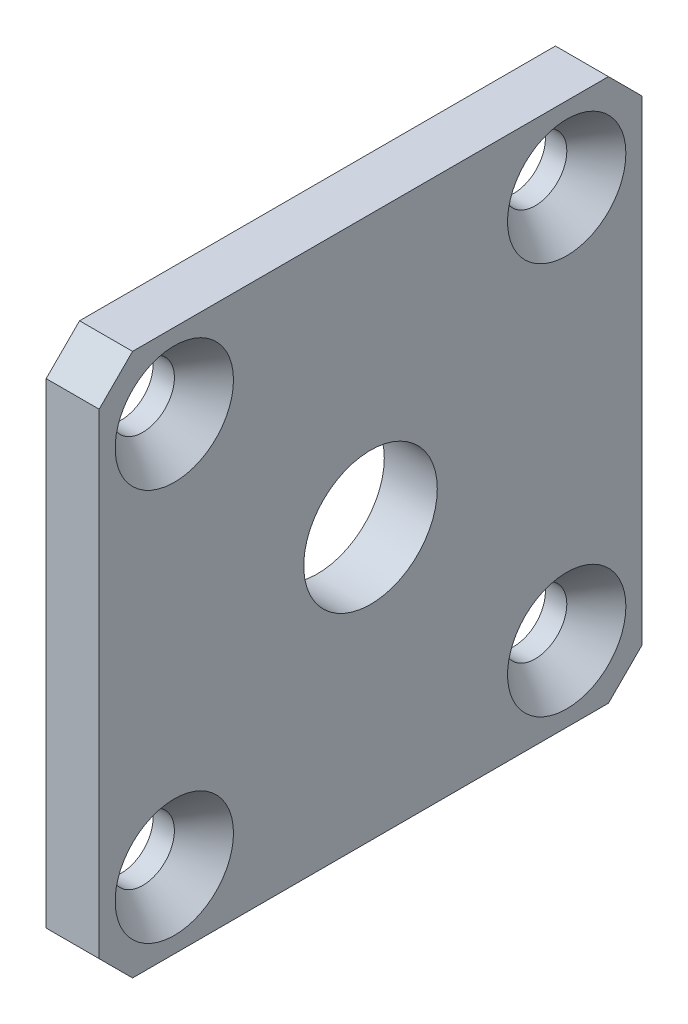
ISO-10303-21;
HEADER;
FILE_DESCRIPTION(('STEP AP214'),'2;1');
FILE_NAME('part.step','',(''),(''),'','','');
FILE_SCHEMA(('AUTOMOTIVE_DESIGN { 1 0 10303 214 1 1 1 1 }'));
ENDSEC;
DATA;
#1=APPLICATION_CONTEXT('core data for automotive mechanical design processes');
#2=APPLICATION_PROTOCOL_DEFINITION('international standard','automotive_design',2000,#1);
#3=PRODUCT_CONTEXT('',#1,'mechanical');
#4=PRODUCT('Part','Part','',(#3));
#5=PRODUCT_RELATED_PRODUCT_CATEGORY('part','',(#4));
#6=PRODUCT_DEFINITION_FORMATION('','',#4);
#7=PRODUCT_DEFINITION_CONTEXT('part definition',#1,'design');
#8=PRODUCT_DEFINITION('design','',#6,#7);
#9=PRODUCT_DEFINITION_SHAPE('','',#8);
#10=(LENGTH_UNIT() NAMED_UNIT(*) SI_UNIT(.MILLI.,.METRE.));
#11=(NAMED_UNIT(*) PLANE_ANGLE_UNIT() SI_UNIT($,.RADIAN.));
#12=(NAMED_UNIT(*) SI_UNIT($,.STERADIAN.) SOLID_ANGLE_UNIT());
#13=UNCERTAINTY_MEASURE_WITH_UNIT(LENGTH_MEASURE(1.E-05),#10,'distance_accuracy_value','');
#14=(GEOMETRIC_REPRESENTATION_CONTEXT(3) GLOBAL_UNCERTAINTY_ASSIGNED_CONTEXT((#13)) GLOBAL_UNIT_ASSIGNED_CONTEXT((#10,
#11,#12)) REPRESENTATION_CONTEXT('',''));
#15=CARTESIAN_POINT('',(0.,0.,0.));
#16=DIRECTION('',(0.,0.,1.));
#17=DIRECTION('',(1.,0.,0.));
#18=AXIS2_PLACEMENT_3D('',#15,#16,#17);
#19=CARTESIAN_POINT('',(3.175,0.,0.));
#20=DIRECTION('',(1.,0.,0.));
#21=DIRECTION('',(0.,0.,-1.));
#22=AXIS2_PLACEMENT_3D('',#19,#20,#21);
#23=PLANE('',#22);
#24=CARTESIAN_POINT('',(3.175,11.75,11.75));
#25=DIRECTION('',(1.,0.,0.));
#26=DIRECTION('',(0.,0.,-1.));
#27=AXIS2_PLACEMENT_3D('',#24,#25,#26);
#28=CIRCLE('',#27,3.5433);
#29=CARTESIAN_POINT('',(3.175,11.75,8.2067));
#30=VERTEX_POINT('',#29);
#31=EDGE_CURVE('E219',#30,#30,#28,.T.);
#32=ORIENTED_EDGE('',*,*,#31,.F.);
#33=EDGE_LOOP('',(#32));
#34=FACE_BOUND('',#33,.T.);
#35=CARTESIAN_POINT('',(3.175,11.75,-11.75));
#36=DIRECTION('',(1.,0.,0.));
#37=DIRECTION('',(0.,0.,-1.));
#38=AXIS2_PLACEMENT_3D('',#35,#36,#37);
#39=CIRCLE('',#38,3.5433);
#40=CARTESIAN_POINT('',(3.175,11.75,-15.2933));
#41=VERTEX_POINT('',#40);
#42=EDGE_CURVE('E210',#41,#41,#39,.T.);
#43=ORIENTED_EDGE('',*,*,#42,.F.);
#44=EDGE_LOOP('',(#43));
#45=FACE_BOUND('',#44,.T.);
#46=CARTESIAN_POINT('',(3.175,-11.75,-11.75));
#47=DIRECTION('',(1.,0.,0.));
#48=DIRECTION('',(0.,0.,-1.));
#49=AXIS2_PLACEMENT_3D('',#46,#47,#48);
#50=CIRCLE('',#49,3.5433);
#51=CARTESIAN_POINT('',(3.175,-11.75,-15.2933));
#52=VERTEX_POINT('',#51);
#53=EDGE_CURVE('E201',#52,#52,#50,.T.);
#54=ORIENTED_EDGE('',*,*,#53,.F.);
#55=EDGE_LOOP('',(#54));
#56=FACE_BOUND('',#55,.T.);
#57=CARTESIAN_POINT('',(3.175,-11.75,11.75));
#58=DIRECTION('',(1.,0.,0.));
#59=DIRECTION('',(0.,0.,-1.));
#60=AXIS2_PLACEMENT_3D('',#57,#58,#59);
#61=CIRCLE('',#60,3.5433);
#62=CARTESIAN_POINT('',(3.175,-11.75,8.2067));
#63=VERTEX_POINT('',#62);
#64=EDGE_CURVE('E192',#63,#63,#61,.T.);
#65=ORIENTED_EDGE('',*,*,#64,.F.);
#66=EDGE_LOOP('',(#65));
#67=FACE_BOUND('',#66,.T.);
#68=DIRECTION('',(0.,0.,-1.));
#69=VECTOR('',#68,1.);
#70=CARTESIAN_POINT('',(3.175,-16.25,16.25));
#71=LINE('',#70,#69);
#72=CARTESIAN_POINT('',(3.175,-16.25,14.25));
#73=VERTEX_POINT('',#72);
#74=CARTESIAN_POINT('',(3.175,-16.25,-14.25));
#75=VERTEX_POINT('',#74);
#76=EDGE_CURVE('E170',#73,#75,#71,.T.);
#77=ORIENTED_EDGE('',*,*,#76,.T.);
#78=DIRECTION('',(0.,-0.707106781186546,0.707106781186549));
#79=VECTOR('',#78,1.);
#80=CARTESIAN_POINT('',(3.175,-15.25,-15.25));
#81=LINE('',#80,#79);
#82=CARTESIAN_POINT('',(3.175,-14.25,-16.25));
#83=VERTEX_POINT('',#82);
#84=EDGE_CURVE('E150',#75,#83,#81,.F.);
#85=ORIENTED_EDGE('',*,*,#84,.T.);
#86=DIRECTION('',(0.,1.,0.));
#87=VECTOR('',#86,1.);
#88=CARTESIAN_POINT('',(3.175,16.25,-16.25));
#89=LINE('',#88,#87);
#90=CARTESIAN_POINT('',(3.175,14.25,-16.25));
#91=VERTEX_POINT('',#90);
#92=EDGE_CURVE('E120',#83,#91,#89,.T.);
#93=ORIENTED_EDGE('',*,*,#92,.T.);
#94=DIRECTION('',(0.,-0.707106781186548,-0.707106781186548));
#95=VECTOR('',#94,1.);
#96=CARTESIAN_POINT('',(3.175,15.25,-15.25));
#97=LINE('',#96,#95);
#98=CARTESIAN_POINT('',(3.175,16.25,-14.25));
#99=VERTEX_POINT('',#98);
#100=EDGE_CURVE('E56',#91,#99,#97,.F.);
#101=ORIENTED_EDGE('',*,*,#100,.T.);
#102=DIRECTION('',(0.,0.,1.));
#103=VECTOR('',#102,1.);
#104=CARTESIAN_POINT('',(3.175,16.25,16.25));
#105=LINE('',#104,#103);
#106=CARTESIAN_POINT('',(3.175,16.25,14.25));
#107=VERTEX_POINT('',#106);
#108=EDGE_CURVE('E137',#99,#107,#105,.T.);
#109=ORIENTED_EDGE('',*,*,#108,.T.);
#110=DIRECTION('',(0.,0.707106781186546,-0.707106781186549));
#111=VECTOR('',#110,1.);
#112=CARTESIAN_POINT('',(3.175,15.25,15.25));
#113=LINE('',#112,#111);
#114=CARTESIAN_POINT('',(3.175,14.25,16.25));
#115=VERTEX_POINT('',#114);
#116=EDGE_CURVE('E145',#107,#115,#113,.F.);
#117=ORIENTED_EDGE('',*,*,#116,.T.);
#118=DIRECTION('',(0.,-1.,0.));
#119=VECTOR('',#118,1.);
#120=CARTESIAN_POINT('',(3.175,16.25,16.25));
#121=LINE('',#120,#119);
#122=CARTESIAN_POINT('',(3.175,-14.25,16.25));
#123=VERTEX_POINT('',#122);
#124=EDGE_CURVE('E131',#115,#123,#121,.T.);
#125=ORIENTED_EDGE('',*,*,#124,.T.);
#126=DIRECTION('',(0.,0.707106781186549,0.707106781186546));
#127=VECTOR('',#126,1.);
#128=CARTESIAN_POINT('',(3.175,-15.25,15.25));
#129=LINE('',#128,#127);
#130=EDGE_CURVE('E148',#123,#73,#129,.F.);
#131=ORIENTED_EDGE('',*,*,#130,.T.);
#132=EDGE_LOOP('',(#77,#85,#93,#101,#109,#117,#125,#131));
#133=FACE_BOUND('',#132,.T.);
#134=CARTESIAN_POINT('',(3.175,0.,0.));
#135=DIRECTION('',(1.,0.,0.));
#136=DIRECTION('',(0.,0.,-1.));
#137=AXIS2_PLACEMENT_3D('',#134,#135,#136);
#138=CIRCLE('',#137,4.);
#139=CARTESIAN_POINT('',(3.175,0.,-4.));
#140=VERTEX_POINT('',#139);
#141=EDGE_CURVE('E176',#140,#140,#138,.T.);
#142=ORIENTED_EDGE('',*,*,#141,.F.);
#143=EDGE_LOOP('',(#142));
#144=FACE_BOUND('',#143,.T.);
#145=ADVANCED_FACE('F35',(#34,#45,#56,#67,#133,#144),#23,.T.);
#146=CARTESIAN_POINT('',(0.,0.,0.));
#147=DIRECTION('',(1.,0.,0.));
#148=DIRECTION('',(0.,0.,-1.));
#149=AXIS2_PLACEMENT_3D('',#146,#147,#148);
#150=PLANE('',#149);
#151=CARTESIAN_POINT('',(0.,11.75,11.75));
#152=DIRECTION('',(1.,0.,0.));
#153=DIRECTION('',(0.,0.,-1.));
#154=AXIS2_PLACEMENT_3D('',#151,#152,#153);
#155=CIRCLE('',#154,1.89865);
#156=CARTESIAN_POINT('',(0.,11.75,9.85135));
#157=VERTEX_POINT('',#156);
#158=EDGE_CURVE('E213',#157,#157,#155,.T.);
#159=ORIENTED_EDGE('',*,*,#158,.T.);
#160=EDGE_LOOP('',(#159));
#161=FACE_BOUND('',#160,.T.);
#162=CARTESIAN_POINT('',(0.,11.75,-11.75));
#163=DIRECTION('',(1.,0.,0.));
#164=DIRECTION('',(0.,0.,-1.));
#165=AXIS2_PLACEMENT_3D('',#162,#163,#164);
#166=CIRCLE('',#165,1.89865);
#167=CARTESIAN_POINT('',(0.,11.75,-13.64865));
#168=VERTEX_POINT('',#167);
#169=EDGE_CURVE('E204',#168,#168,#166,.T.);
#170=ORIENTED_EDGE('',*,*,#169,.T.);
#171=EDGE_LOOP('',(#170));
#172=FACE_BOUND('',#171,.T.);
#173=CARTESIAN_POINT('',(0.,-11.75,-11.75));
#174=DIRECTION('',(1.,0.,0.));
#175=DIRECTION('',(0.,0.,-1.));
#176=AXIS2_PLACEMENT_3D('',#173,#174,#175);
#177=CIRCLE('',#176,1.89865);
#178=CARTESIAN_POINT('',(0.,-11.75,-13.64865));
#179=VERTEX_POINT('',#178);
#180=EDGE_CURVE('E195',#179,#179,#177,.T.);
#181=ORIENTED_EDGE('',*,*,#180,.T.);
#182=EDGE_LOOP('',(#181));
#183=FACE_BOUND('',#182,.T.);
#184=CARTESIAN_POINT('',(0.,-11.75,11.75));
#185=DIRECTION('',(1.,0.,0.));
#186=DIRECTION('',(0.,0.,-1.));
#187=AXIS2_PLACEMENT_3D('',#184,#185,#186);
#188=CIRCLE('',#187,1.89865);
#189=CARTESIAN_POINT('',(0.,-11.75,9.85135));
#190=VERTEX_POINT('',#189);
#191=EDGE_CURVE('E185',#190,#190,#188,.T.);
#192=ORIENTED_EDGE('',*,*,#191,.T.);
#193=EDGE_LOOP('',(#192));
#194=FACE_BOUND('',#193,.T.);
#195=DIRECTION('',(0.,1.,0.));
#196=VECTOR('',#195,1.);
#197=CARTESIAN_POINT('',(0.,16.25,-16.25));
#198=LINE('',#197,#196);
#199=CARTESIAN_POINT('',(0.,-14.25,-16.25));
#200=VERTEX_POINT('',#199);
#201=CARTESIAN_POINT('',(0.,14.25,-16.25));
#202=VERTEX_POINT('',#201);
#203=EDGE_CURVE('E118',#200,#202,#198,.T.);
#204=ORIENTED_EDGE('',*,*,#203,.F.);
#205=DIRECTION('',(0.,0.707106781186546,-0.707106781186549));
#206=VECTOR('',#205,1.);
#207=CARTESIAN_POINT('',(0.,-14.25,-16.25));
#208=LINE('',#207,#206);
#209=CARTESIAN_POINT('',(0.,-16.25,-14.25));
#210=VERTEX_POINT('',#209);
#211=EDGE_CURVE('E101',#200,#210,#208,.F.);
#212=ORIENTED_EDGE('',*,*,#211,.T.);
#213=DIRECTION('',(0.,0.,-1.));
#214=VECTOR('',#213,1.);
#215=CARTESIAN_POINT('',(0.,-16.25,16.25));
#216=LINE('',#215,#214);
#217=CARTESIAN_POINT('',(0.,-16.25,14.25));
#218=VERTEX_POINT('',#217);
#219=EDGE_CURVE('E129',#218,#210,#216,.T.);
#220=ORIENTED_EDGE('',*,*,#219,.F.);
#221=DIRECTION('',(0.,-0.707106781186549,-0.707106781186546));
#222=VECTOR('',#221,1.);
#223=CARTESIAN_POINT('',(0.,-16.25,14.25));
#224=LINE('',#223,#222);
#225=CARTESIAN_POINT('',(0.,-14.25,16.25));
#226=VERTEX_POINT('',#225);
#227=EDGE_CURVE('E112',#218,#226,#224,.F.);
#228=ORIENTED_EDGE('',*,*,#227,.T.);
#229=DIRECTION('',(0.,-1.,0.));
#230=VECTOR('',#229,1.);
#231=CARTESIAN_POINT('',(0.,16.25,16.25));
#232=LINE('',#231,#230);
#233=CARTESIAN_POINT('',(0.,14.25,16.25));
#234=VERTEX_POINT('',#233);
#235=EDGE_CURVE('E133',#234,#226,#232,.T.);
#236=ORIENTED_EDGE('',*,*,#235,.F.);
#237=DIRECTION('',(0.,-0.707106781186546,0.707106781186549));
#238=VECTOR('',#237,1.);
#239=CARTESIAN_POINT('',(0.,14.25,16.25));
#240=LINE('',#239,#238);
#241=CARTESIAN_POINT('',(0.,16.25,14.25));
#242=VERTEX_POINT('',#241);
#243=EDGE_CURVE('E121',#234,#242,#240,.F.);
#244=ORIENTED_EDGE('',*,*,#243,.T.);
#245=DIRECTION('',(0.,0.,1.));
#246=VECTOR('',#245,1.);
#247=CARTESIAN_POINT('',(0.,16.25,16.25));
#248=LINE('',#247,#246);
#249=CARTESIAN_POINT('',(0.,16.25,-14.25));
#250=VERTEX_POINT('',#249);
#251=EDGE_CURVE('E128',#250,#242,#248,.T.);
#252=ORIENTED_EDGE('',*,*,#251,.F.);
#253=DIRECTION('',(0.,0.707106781186548,0.707106781186548));
#254=VECTOR('',#253,1.);
#255=CARTESIAN_POINT('',(0.,16.25,-14.25));
#256=LINE('',#255,#254);
#257=EDGE_CURVE('E127',#250,#202,#256,.F.);
#258=ORIENTED_EDGE('',*,*,#257,.T.);
#259=EDGE_LOOP('',(#204,#212,#220,#228,#236,#244,#252,#258));
#260=FACE_BOUND('',#259,.T.);
#261=CARTESIAN_POINT('',(0.,0.,0.));
#262=DIRECTION('',(1.,0.,0.));
#263=DIRECTION('',(0.,0.,-1.));
#264=AXIS2_PLACEMENT_3D('',#261,#262,#263);
#265=CIRCLE('',#264,4.);
#266=CARTESIAN_POINT('',(0.,0.,-4.));
#267=VERTEX_POINT('',#266);
#268=EDGE_CURVE('E178',#267,#267,#265,.T.);
#269=ORIENTED_EDGE('',*,*,#268,.T.);
#270=EDGE_LOOP('',(#269));
#271=FACE_BOUND('',#270,.T.);
#272=ADVANCED_FACE('F124',(#161,#172,#183,#194,#260,#271),#150,.F.);
#273=CARTESIAN_POINT('',(3.175,16.25,16.25));
#274=DIRECTION('',(0.,0.,-1.));
#275=DIRECTION('',(0.,1.,0.));
#276=AXIS2_PLACEMENT_3D('',#273,#274,#275);
#277=PLANE('',#276);
#278=ORIENTED_EDGE('',*,*,#235,.T.);
#279=DIRECTION('',(1.,0.,0.));
#280=VECTOR('',#279,1.);
#281=CARTESIAN_POINT('',(3.175,-14.25,16.25));
#282=LINE('',#281,#280);
#283=EDGE_CURVE('E155',#226,#123,#282,.T.);
#284=ORIENTED_EDGE('',*,*,#283,.T.);
#285=ORIENTED_EDGE('',*,*,#124,.F.);
#286=DIRECTION('',(-1.,0.,0.));
#287=VECTOR('',#286,1.);
#288=CARTESIAN_POINT('',(3.175,14.25,16.25));
#289=LINE('',#288,#287);
#290=EDGE_CURVE('E152',#115,#234,#289,.T.);
#291=ORIENTED_EDGE('',*,*,#290,.T.);
#292=EDGE_LOOP('',(#278,#284,#285,#291));
#293=FACE_BOUND('',#292,.T.);
#294=ADVANCED_FACE('F161',(#293),#277,.F.);
#295=CARTESIAN_POINT('',(3.175,-16.25,16.25));
#296=DIRECTION('',(0.,1.,0.));
#297=DIRECTION('',(0.,0.,1.));
#298=AXIS2_PLACEMENT_3D('',#295,#296,#297);
#299=PLANE('',#298);
#300=ORIENTED_EDGE('',*,*,#219,.T.);
#301=DIRECTION('',(1.,0.,0.));
#302=VECTOR('',#301,1.);
#303=CARTESIAN_POINT('',(3.175,-16.25,-14.25));
#304=LINE('',#303,#302);
#305=EDGE_CURVE('E106',#210,#75,#304,.T.);
#306=ORIENTED_EDGE('',*,*,#305,.T.);
#307=ORIENTED_EDGE('',*,*,#76,.F.);
#308=DIRECTION('',(-1.,0.,0.));
#309=VECTOR('',#308,1.);
#310=CARTESIAN_POINT('',(3.175,-16.25,14.25));
#311=LINE('',#310,#309);
#312=EDGE_CURVE('E111',#73,#218,#311,.T.);
#313=ORIENTED_EDGE('',*,*,#312,.T.);
#314=EDGE_LOOP('',(#300,#306,#307,#313));
#315=FACE_BOUND('',#314,.T.);
#316=ADVANCED_FACE('F175',(#315),#299,.F.);
#317=CARTESIAN_POINT('',(3.175,16.25,-16.25));
#318=DIRECTION('',(0.,0.,1.));
#319=DIRECTION('',(0.,-1.,0.));
#320=AXIS2_PLACEMENT_3D('',#317,#318,#319);
#321=PLANE('',#320);
#322=ORIENTED_EDGE('',*,*,#92,.F.);
#323=DIRECTION('',(-1.,0.,0.));
#324=VECTOR('',#323,1.);
#325=CARTESIAN_POINT('',(3.175,-14.25,-16.25));
#326=LINE('',#325,#324);
#327=EDGE_CURVE('E105',#83,#200,#326,.T.);
#328=ORIENTED_EDGE('',*,*,#327,.T.);
#329=ORIENTED_EDGE('',*,*,#203,.T.);
#330=DIRECTION('',(1.,0.,0.));
#331=VECTOR('',#330,1.);
#332=CARTESIAN_POINT('',(3.175,14.25,-16.25));
#333=LINE('',#332,#331);
#334=EDGE_CURVE('E122',#202,#91,#333,.T.);
#335=ORIENTED_EDGE('',*,*,#334,.T.);
#336=EDGE_LOOP('',(#322,#328,#329,#335));
#337=FACE_BOUND('',#336,.T.);
#338=ADVANCED_FACE('F117',(#337),#321,.F.);
#339=CARTESIAN_POINT('',(3.175,16.25,16.25));
#340=DIRECTION('',(0.,-1.,0.));
#341=DIRECTION('',(0.,0.,-1.));
#342=AXIS2_PLACEMENT_3D('',#339,#340,#341);
#343=PLANE('',#342);
#344=ORIENTED_EDGE('',*,*,#108,.F.);
#345=DIRECTION('',(-1.,0.,0.));
#346=VECTOR('',#345,1.);
#347=CARTESIAN_POINT('',(3.175,16.25,-14.25));
#348=LINE('',#347,#346);
#349=EDGE_CURVE('E11',#99,#250,#348,.T.);
#350=ORIENTED_EDGE('',*,*,#349,.T.);
#351=ORIENTED_EDGE('',*,*,#251,.T.);
#352=DIRECTION('',(1.,0.,0.));
#353=VECTOR('',#352,1.);
#354=CARTESIAN_POINT('',(3.175,16.25,14.25));
#355=LINE('',#354,#353);
#356=EDGE_CURVE('E43',#242,#107,#355,.T.);
#357=ORIENTED_EDGE('',*,*,#356,.T.);
#358=EDGE_LOOP('',(#344,#350,#351,#357));
#359=FACE_BOUND('',#358,.T.);
#360=ADVANCED_FACE('F254',(#359),#343,.F.);
#361=CARTESIAN_POINT('',(3.175,0.,0.));
#362=DIRECTION('',(-1.,0.,0.));
#363=DIRECTION('',(0.,0.,1.));
#364=AXIS2_PLACEMENT_3D('',#361,#362,#363);
#365=CYLINDRICAL_SURFACE('',#364,4.);
#366=ORIENTED_EDGE('',*,*,#141,.T.);
#367=EDGE_LOOP('',(#366));
#368=FACE_BOUND('',#367,.T.);
#369=ORIENTED_EDGE('',*,*,#268,.F.);
#370=EDGE_LOOP('',(#369));
#371=FACE_BOUND('',#370,.T.);
#372=ADVANCED_FACE('F252',(#368,#371),#365,.F.);
#373=CARTESIAN_POINT('',(3.175,-14.25,-16.25));
#374=DIRECTION('',(0.,0.707106781186549,0.707106781186546));
#375=DIRECTION('',(-1.,0.,0.));
#376=AXIS2_PLACEMENT_3D('',#373,#374,#375);
#377=PLANE('',#376);
#378=ORIENTED_EDGE('',*,*,#84,.F.);
#379=ORIENTED_EDGE('',*,*,#305,.F.);
#380=ORIENTED_EDGE('',*,*,#211,.F.);
#381=ORIENTED_EDGE('',*,*,#327,.F.);
#382=EDGE_LOOP('',(#378,#379,#380,#381));
#383=FACE_BOUND('',#382,.T.);
#384=ADVANCED_FACE('F104',(#383),#377,.F.);
#385=CARTESIAN_POINT('',(3.175,-16.25,14.25));
#386=DIRECTION('',(0.,0.707106781186546,-0.707106781186549));
#387=DIRECTION('',(-1.,0.,0.));
#388=AXIS2_PLACEMENT_3D('',#385,#386,#387);
#389=PLANE('',#388);
#390=ORIENTED_EDGE('',*,*,#130,.F.);
#391=ORIENTED_EDGE('',*,*,#283,.F.);
#392=ORIENTED_EDGE('',*,*,#227,.F.);
#393=ORIENTED_EDGE('',*,*,#312,.F.);
#394=EDGE_LOOP('',(#390,#391,#392,#393));
#395=FACE_BOUND('',#394,.T.);
#396=ADVANCED_FACE('F173',(#395),#389,.F.);
#397=CARTESIAN_POINT('',(3.175,16.25,-14.25));
#398=DIRECTION('',(0.,-0.707106781186548,0.707106781186548));
#399=DIRECTION('',(-1.,0.,0.));
#400=AXIS2_PLACEMENT_3D('',#397,#398,#399);
#401=PLANE('',#400);
#402=ORIENTED_EDGE('',*,*,#100,.F.);
#403=ORIENTED_EDGE('',*,*,#334,.F.);
#404=ORIENTED_EDGE('',*,*,#257,.F.);
#405=ORIENTED_EDGE('',*,*,#349,.F.);
#406=EDGE_LOOP('',(#402,#403,#404,#405));
#407=FACE_BOUND('',#406,.T.);
#408=ADVANCED_FACE('F271',(#407),#401,.F.);
#409=CARTESIAN_POINT('',(3.175,14.25,16.25));
#410=DIRECTION('',(0.,-0.707106781186549,-0.707106781186546));
#411=DIRECTION('',(-1.,0.,0.));
#412=AXIS2_PLACEMENT_3D('',#409,#410,#411);
#413=PLANE('',#412);
#414=ORIENTED_EDGE('',*,*,#116,.F.);
#415=ORIENTED_EDGE('',*,*,#356,.F.);
#416=ORIENTED_EDGE('',*,*,#243,.F.);
#417=ORIENTED_EDGE('',*,*,#290,.F.);
#418=EDGE_LOOP('',(#414,#415,#416,#417));
#419=FACE_BOUND('',#418,.T.);
#420=ADVANCED_FACE('F37',(#419),#413,.F.);
#421=CARTESIAN_POINT('',(3.175,-11.75,11.75));
#422=DIRECTION('',(1.,0.,0.));
#423=DIRECTION('',(0.,0.,-1.));
#424=AXIS2_PLACEMENT_3D('',#421,#422,#423);
#425=CYLINDRICAL_SURFACE('',#424,1.89865);
#426=ORIENTED_EDGE('',*,*,#191,.F.);
#427=EDGE_LOOP('',(#426));
#428=FACE_BOUND('',#427,.T.);
#429=CARTESIAN_POINT('',(1.28304659906397,-11.75,11.75));
#430=DIRECTION('',(1.,0.,0.));
#431=DIRECTION('',(0.,0.,-1.));
#432=AXIS2_PLACEMENT_3D('',#429,#430,#431);
#433=CIRCLE('',#432,1.89865);
#434=CARTESIAN_POINT('',(1.28304659906397,-11.75,9.85135));
#435=VERTEX_POINT('',#434);
#436=EDGE_CURVE('E189',#435,#435,#433,.T.);
#437=ORIENTED_EDGE('',*,*,#436,.T.);
#438=EDGE_LOOP('',(#437));
#439=FACE_BOUND('',#438,.T.);
#440=ADVANCED_FACE('F237',(#428,#439),#425,.F.);
#441=CARTESIAN_POINT('',(3.175,-11.75,11.75));
#442=DIRECTION('',(1.,0.,0.));
#443=DIRECTION('',(0.,0.,-1.));
#444=AXIS2_PLACEMENT_3D('',#441,#442,#443);
#445=CONICAL_SURFACE('',#444,3.5433,0.715584993317677);
#446=ORIENTED_EDGE('',*,*,#436,.F.);
#447=EDGE_LOOP('',(#446));
#448=FACE_BOUND('',#447,.T.);
#449=ORIENTED_EDGE('',*,*,#64,.T.);
#450=EDGE_LOOP('',(#449));
#451=FACE_BOUND('',#450,.T.);
#452=ADVANCED_FACE('F234',(#448,#451),#445,.F.);
#453=CARTESIAN_POINT('',(3.175,-11.75,-11.75));
#454=DIRECTION('',(1.,0.,0.));
#455=DIRECTION('',(0.,0.,-1.));
#456=AXIS2_PLACEMENT_3D('',#453,#454,#455);
#457=CYLINDRICAL_SURFACE('',#456,1.89865);
#458=ORIENTED_EDGE('',*,*,#180,.F.);
#459=EDGE_LOOP('',(#458));
#460=FACE_BOUND('',#459,.T.);
#461=CARTESIAN_POINT('',(1.28304659906397,-11.75,-11.75));
#462=DIRECTION('',(1.,0.,0.));
#463=DIRECTION('',(0.,0.,-1.));
#464=AXIS2_PLACEMENT_3D('',#461,#462,#463);
#465=CIRCLE('',#464,1.89865);
#466=CARTESIAN_POINT('',(1.28304659906397,-11.75,-13.64865));
#467=VERTEX_POINT('',#466);
#468=EDGE_CURVE('E198',#467,#467,#465,.T.);
#469=ORIENTED_EDGE('',*,*,#468,.T.);
#470=EDGE_LOOP('',(#469));
#471=FACE_BOUND('',#470,.T.);
#472=ADVANCED_FACE('F236',(#460,#471),#457,.F.);
#473=CARTESIAN_POINT('',(3.175,-11.75,-11.75));
#474=DIRECTION('',(1.,0.,0.));
#475=DIRECTION('',(0.,0.,-1.));
#476=AXIS2_PLACEMENT_3D('',#473,#474,#475);
#477=CONICAL_SURFACE('',#476,3.5433,0.715584993317677);
#478=ORIENTED_EDGE('',*,*,#468,.F.);
#479=EDGE_LOOP('',(#478));
#480=FACE_BOUND('',#479,.T.);
#481=ORIENTED_EDGE('',*,*,#53,.T.);
#482=EDGE_LOOP('',(#481));
#483=FACE_BOUND('',#482,.T.);
#484=ADVANCED_FACE('F244',(#480,#483),#477,.F.);
#485=CARTESIAN_POINT('',(3.175,11.75,-11.75));
#486=DIRECTION('',(1.,0.,0.));
#487=DIRECTION('',(0.,0.,-1.));
#488=AXIS2_PLACEMENT_3D('',#485,#486,#487);
#489=CYLINDRICAL_SURFACE('',#488,1.89865);
#490=ORIENTED_EDGE('',*,*,#169,.F.);
#491=EDGE_LOOP('',(#490));
#492=FACE_BOUND('',#491,.T.);
#493=CARTESIAN_POINT('',(1.28304659906397,11.75,-11.75));
#494=DIRECTION('',(1.,0.,0.));
#495=DIRECTION('',(0.,0.,-1.));
#496=AXIS2_PLACEMENT_3D('',#493,#494,#495);
#497=CIRCLE('',#496,1.89865);
#498=CARTESIAN_POINT('',(1.28304659906397,11.75,-13.64865));
#499=VERTEX_POINT('',#498);
#500=EDGE_CURVE('E207',#499,#499,#497,.T.);
#501=ORIENTED_EDGE('',*,*,#500,.T.);
#502=EDGE_LOOP('',(#501));
#503=FACE_BOUND('',#502,.T.);
#504=ADVANCED_FACE('F308',(#492,#503),#489,.F.);
#505=CARTESIAN_POINT('',(3.175,11.75,-11.75));
#506=DIRECTION('',(1.,0.,0.));
#507=DIRECTION('',(0.,0.,-1.));
#508=AXIS2_PLACEMENT_3D('',#505,#506,#507);
#509=CONICAL_SURFACE('',#508,3.5433,0.715584993317677);
#510=ORIENTED_EDGE('',*,*,#500,.F.);
#511=EDGE_LOOP('',(#510));
#512=FACE_BOUND('',#511,.T.);
#513=ORIENTED_EDGE('',*,*,#42,.T.);
#514=EDGE_LOOP('',(#513));
#515=FACE_BOUND('',#514,.T.);
#516=ADVANCED_FACE('F317',(#512,#515),#509,.F.);
#517=CARTESIAN_POINT('',(3.175,11.75,11.75));
#518=DIRECTION('',(1.,0.,0.));
#519=DIRECTION('',(0.,0.,-1.));
#520=AXIS2_PLACEMENT_3D('',#517,#518,#519);
#521=CYLINDRICAL_SURFACE('',#520,1.89865);
#522=ORIENTED_EDGE('',*,*,#158,.F.);
#523=EDGE_LOOP('',(#522));
#524=FACE_BOUND('',#523,.T.);
#525=CARTESIAN_POINT('',(1.28304659906397,11.75,11.75));
#526=DIRECTION('',(1.,0.,0.));
#527=DIRECTION('',(0.,0.,-1.));
#528=AXIS2_PLACEMENT_3D('',#525,#526,#527);
#529=CIRCLE('',#528,1.89865);
#530=CARTESIAN_POINT('',(1.28304659906397,11.75,9.85135));
#531=VERTEX_POINT('',#530);
#532=EDGE_CURVE('E216',#531,#531,#529,.T.);
#533=ORIENTED_EDGE('',*,*,#532,.T.);
#534=EDGE_LOOP('',(#533));
#535=FACE_BOUND('',#534,.T.);
#536=ADVANCED_FACE('F327',(#524,#535),#521,.F.);
#537=CARTESIAN_POINT('',(3.175,11.75,11.75));
#538=DIRECTION('',(1.,0.,0.));
#539=DIRECTION('',(0.,0.,-1.));
#540=AXIS2_PLACEMENT_3D('',#537,#538,#539);
#541=CONICAL_SURFACE('',#540,3.5433,0.715584993317677);
#542=ORIENTED_EDGE('',*,*,#532,.F.);
#543=EDGE_LOOP('',(#542));
#544=FACE_BOUND('',#543,.T.);
#545=ORIENTED_EDGE('',*,*,#31,.T.);
#546=EDGE_LOOP('',(#545));
#547=FACE_BOUND('',#546,.T.);
#548=ADVANCED_FACE('F223',(#544,#547),#541,.F.);
#549=CLOSED_SHELL('',(#145,#272,#294,#316,#338,#360,#372,#384,#396,#408,#420,#440,#452,#472,
#484,#504,#516,#536,#548));
#550=MANIFOLD_SOLID_BREP('B2',#549);
#551=ADVANCED_BREP_SHAPE_REPRESENTATION('',(#18,#550),#14);
#552=SHAPE_DEFINITION_REPRESENTATION(#9,#551);
ENDSEC;
END-ISO-10303-21;
